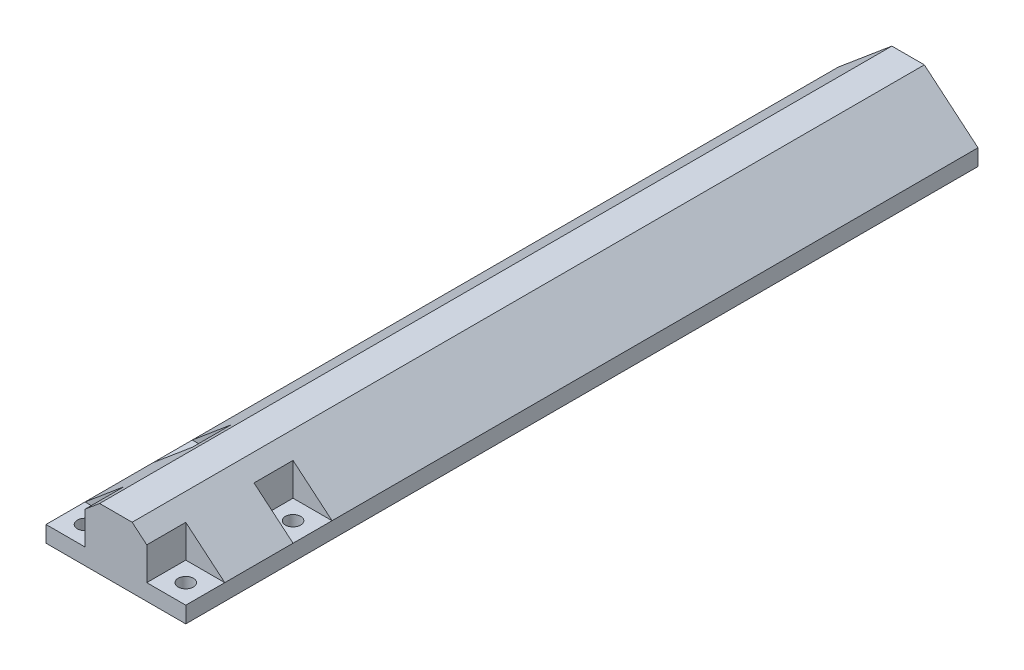
ISO-10303-21;
HEADER;
FILE_DESCRIPTION(('STEP AP214'),'2;1');
FILE_NAME('part.step','',(''),(''),'','','');
FILE_SCHEMA(('AUTOMOTIVE_DESIGN { 1 0 10303 214 1 1 1 1 }'));
ENDSEC;
DATA;
#1=APPLICATION_CONTEXT('core data for automotive mechanical design processes');
#2=APPLICATION_PROTOCOL_DEFINITION('international standard','automotive_design',2000,#1);
#3=PRODUCT_CONTEXT('',#1,'mechanical');
#4=PRODUCT('Part','Part','',(#3));
#5=PRODUCT_RELATED_PRODUCT_CATEGORY('part','',(#4));
#6=PRODUCT_DEFINITION_FORMATION('','',#4);
#7=PRODUCT_DEFINITION_CONTEXT('part definition',#1,'design');
#8=PRODUCT_DEFINITION('design','',#6,#7);
#9=PRODUCT_DEFINITION_SHAPE('','',#8);
#10=(LENGTH_UNIT() NAMED_UNIT(*) SI_UNIT(.MILLI.,.METRE.));
#11=(NAMED_UNIT(*) PLANE_ANGLE_UNIT() SI_UNIT($,.RADIAN.));
#12=(NAMED_UNIT(*) SI_UNIT($,.STERADIAN.) SOLID_ANGLE_UNIT());
#13=UNCERTAINTY_MEASURE_WITH_UNIT(LENGTH_MEASURE(1.E-05),#10,'distance_accuracy_value','');
#14=(GEOMETRIC_REPRESENTATION_CONTEXT(3) GLOBAL_UNCERTAINTY_ASSIGNED_CONTEXT((#13)) GLOBAL_UNIT_ASSIGNED_CONTEXT((#10,
#11,#12)) REPRESENTATION_CONTEXT('',''));
#15=CARTESIAN_POINT('',(0.,0.,0.));
#16=DIRECTION('',(0.,0.,1.));
#17=DIRECTION('',(1.,0.,0.));
#18=AXIS2_PLACEMENT_3D('',#15,#16,#17);
#19=CARTESIAN_POINT('',(-21.5,5.,22.5));
#20=DIRECTION('',(0.,0.,-1.));
#21=DIRECTION('',(-1.,0.,0.));
#22=AXIS2_PLACEMENT_3D('',#19,#20,#21);
#23=PLANE('',#22);
#24=DIRECTION('',(-0.766044443118977,-0.642787609686541,0.));
#25=VECTOR('',#24,1.);
#26=CARTESIAN_POINT('',(-11.3453014726111,13.5208037890486,22.5));
#27=LINE('',#26,#25);
#28=CARTESIAN_POINT('',(-5.00000000000002,18.8451439144252,22.5));
#29=VERTEX_POINT('',#28);
#30=CARTESIAN_POINT('',(-9.5,15.0691955741274,22.5));
#31=VERTEX_POINT('',#30);
#32=EDGE_CURVE('E246',#29,#31,#27,.T.);
#33=ORIENTED_EDGE('',*,*,#32,.T.);
#34=DIRECTION('',(0.,1.,0.));
#35=VECTOR('',#34,1.);
#36=CARTESIAN_POINT('',(-9.5,5.,22.5));
#37=LINE('',#36,#35);
#38=CARTESIAN_POINT('',(-9.5,5.,22.5));
#39=VERTEX_POINT('',#38);
#40=EDGE_CURVE('E214',#39,#31,#37,.T.);
#41=ORIENTED_EDGE('',*,*,#40,.F.);
#42=DIRECTION('',(-1.,0.,0.));
#43=VECTOR('',#42,1.);
#44=CARTESIAN_POINT('',(0.,5.,22.5));
#45=LINE('',#44,#43);
#46=CARTESIAN_POINT('',(-21.5,5.,22.5));
#47=VERTEX_POINT('',#46);
#48=EDGE_CURVE('E206',#39,#47,#45,.T.);
#49=ORIENTED_EDGE('',*,*,#48,.T.);
#50=DIRECTION('',(0.,-1.,0.));
#51=VECTOR('',#50,1.);
#52=CARTESIAN_POINT('',(-21.5,5.,22.5));
#53=LINE('',#52,#51);
#54=CARTESIAN_POINT('',(-21.5,0.,22.5));
#55=VERTEX_POINT('',#54);
#56=EDGE_CURVE('E292',#47,#55,#53,.T.);
#57=ORIENTED_EDGE('',*,*,#56,.T.);
#58=DIRECTION('',(1.,0.,0.));
#59=VECTOR('',#58,1.);
#60=CARTESIAN_POINT('',(-21.5,0.,22.5));
#61=LINE('',#60,#59);
#62=CARTESIAN_POINT('',(21.5,0.,22.5));
#63=VERTEX_POINT('',#62);
#64=EDGE_CURVE('E288',#55,#63,#61,.T.);
#65=ORIENTED_EDGE('',*,*,#64,.T.);
#66=DIRECTION('',(0.,-1.,0.));
#67=VECTOR('',#66,1.);
#68=CARTESIAN_POINT('',(21.5,5.,22.5));
#69=LINE('',#68,#67);
#70=CARTESIAN_POINT('',(21.5,5.,22.5));
#71=VERTEX_POINT('',#70);
#72=EDGE_CURVE('E284',#71,#63,#69,.T.);
#73=ORIENTED_EDGE('',*,*,#72,.F.);
#74=DIRECTION('',(1.,0.,0.));
#75=VECTOR('',#74,1.);
#76=CARTESIAN_POINT('',(0.,5.,22.5));
#77=LINE('',#76,#75);
#78=CARTESIAN_POINT('',(9.5,5.,22.5));
#79=VERTEX_POINT('',#78);
#80=EDGE_CURVE('E220',#79,#71,#77,.T.);
#81=ORIENTED_EDGE('',*,*,#80,.F.);
#82=DIRECTION('',(0.,1.,0.));
#83=VECTOR('',#82,1.);
#84=CARTESIAN_POINT('',(9.5,5.,22.5));
#85=LINE('',#84,#83);
#86=CARTESIAN_POINT('',(9.5,15.0691955741274,22.5));
#87=VERTEX_POINT('',#86);
#88=EDGE_CURVE('E224',#79,#87,#85,.T.);
#89=ORIENTED_EDGE('',*,*,#88,.T.);
#90=DIRECTION('',(-0.766044443118977,0.642787609686541,0.));
#91=VECTOR('',#90,1.);
#92=CARTESIAN_POINT('',(11.3453014726111,13.5208037890486,22.5));
#93=LINE('',#92,#91);
#94=CARTESIAN_POINT('',(4.99999999999999,18.8451439144252,22.5));
#95=VERTEX_POINT('',#94);
#96=EDGE_CURVE('E244',#87,#95,#93,.T.);
#97=ORIENTED_EDGE('',*,*,#96,.T.);
#98=DIRECTION('',(-1.,0.,0.));
#99=VECTOR('',#98,1.);
#100=CARTESIAN_POINT('',(0.,18.8451439144252,22.5));
#101=LINE('',#100,#99);
#102=EDGE_CURVE('E249',#95,#29,#101,.T.);
#103=ORIENTED_EDGE('',*,*,#102,.T.);
#104=EDGE_LOOP('',(#33,#41,#49,#57,#65,#73,#81,#89,#97,#103));
#105=FACE_BOUND('',#104,.T.);
#106=ADVANCED_FACE('F43',(#105),#23,.F.);
#107=CARTESIAN_POINT('',(-11.3453014726111,13.5208037890486,-221.22316262));
#108=DIRECTION('',(0.642787609686541,-0.766044443118977,0.));
#109=DIRECTION('',(0.766044443118977,0.642787609686541,0.));
#110=AXIS2_PLACEMENT_3D('',#107,#108,#109);
#111=PLANE('',#110);
#112=DIRECTION('',(-0.766044443118977,-0.642787609686541,0.));
#113=VECTOR('',#112,1.);
#114=CARTESIAN_POINT('',(-11.3453014726111,13.5208037890486,10.5));
#115=LINE('',#114,#113);
#116=CARTESIAN_POINT('',(-9.5,15.0691955741274,10.5));
#117=VERTEX_POINT('',#116);
#118=CARTESIAN_POINT('',(-21.5,5.,10.5));
#119=VERTEX_POINT('',#118);
#120=EDGE_CURVE('E11',#117,#119,#115,.T.);
#121=ORIENTED_EDGE('',*,*,#120,.F.);
#122=DIRECTION('',(0.,0.,1.));
#123=VECTOR('',#122,1.);
#124=CARTESIAN_POINT('',(-9.5,15.0691955741274,-221.22316262));
#125=LINE('',#124,#123);
#126=EDGE_CURVE('E51',#117,#31,#125,.T.);
#127=ORIENTED_EDGE('',*,*,#126,.T.);
#128=ORIENTED_EDGE('',*,*,#32,.F.);
#129=DIRECTION('',(0.,0.,1.));
#130=VECTOR('',#129,1.);
#131=CARTESIAN_POINT('',(-5.00000000000002,18.8451439144252,-221.22316262));
#132=LINE('',#131,#130);
#133=CARTESIAN_POINT('',(-5.00000000000002,18.8451439144252,-221.22316262));
#134=VERTEX_POINT('',#133);
#135=EDGE_CURVE('E270',#134,#29,#132,.T.);
#136=ORIENTED_EDGE('',*,*,#135,.F.);
#137=DIRECTION('',(0.766044443118977,0.642787609686541,0.));
#138=VECTOR('',#137,1.);
#139=CARTESIAN_POINT('',(-11.3453014726111,13.5208037890486,-221.22316262));
#140=LINE('',#139,#138);
#141=CARTESIAN_POINT('',(-21.5,5.,-221.22316262));
#142=VERTEX_POINT('',#141);
#143=EDGE_CURVE('E252',#142,#134,#140,.T.);
#144=ORIENTED_EDGE('',*,*,#143,.F.);
#145=DIRECTION('',(0.,0.,1.));
#146=VECTOR('',#145,1.);
#147=CARTESIAN_POINT('',(-21.5,5.,22.5));
#148=LINE('',#147,#146);
#149=CARTESIAN_POINT('',(-21.5,5.,-22.5));
#150=VERTEX_POINT('',#149);
#151=EDGE_CURVE('E281',#142,#150,#148,.T.);
#152=ORIENTED_EDGE('',*,*,#151,.T.);
#153=DIRECTION('',(-0.766044443118977,-0.642787609686541,0.));
#154=VECTOR('',#153,1.);
#155=CARTESIAN_POINT('',(-11.3453014726111,13.5208037890486,-22.5));
#156=LINE('',#155,#154);
#157=CARTESIAN_POINT('',(-9.5,15.0691955741274,-22.5));
#158=VERTEX_POINT('',#157);
#159=EDGE_CURVE('E321',#158,#150,#156,.T.);
#160=ORIENTED_EDGE('',*,*,#159,.F.);
#161=DIRECTION('',(0.,0.,1.));
#162=VECTOR('',#161,1.);
#163=CARTESIAN_POINT('',(-9.5,15.0691955741274,-221.22316262));
#164=LINE('',#163,#162);
#165=CARTESIAN_POINT('',(-9.5,15.0691955741274,-10.5));
#166=VERTEX_POINT('',#165);
#167=EDGE_CURVE('E318',#158,#166,#164,.T.);
#168=ORIENTED_EDGE('',*,*,#167,.T.);
#169=DIRECTION('',(-0.766044443118977,-0.642787609686541,0.));
#170=VECTOR('',#169,1.);
#171=CARTESIAN_POINT('',(-11.3453014726111,13.5208037890486,-10.5));
#172=LINE('',#171,#170);
#173=CARTESIAN_POINT('',(-21.5,5.,-10.5));
#174=VERTEX_POINT('',#173);
#175=EDGE_CURVE('E315',#166,#174,#172,.T.);
#176=ORIENTED_EDGE('',*,*,#175,.T.);
#177=EDGE_CURVE('E278',#174,#119,#148,.T.);
#178=ORIENTED_EDGE('',*,*,#177,.T.);
#179=EDGE_LOOP('',(#121,#127,#128,#136,#144,#152,#160,#168,#176,#178));
#180=FACE_BOUND('',#179,.T.);
#181=ADVANCED_FACE('F326',(#180),#111,.F.);
#182=CARTESIAN_POINT('',(11.3453014726111,13.5208037890486,-221.22316262));
#183=DIRECTION('',(-0.642787609686541,-0.766044443118977,0.));
#184=DIRECTION('',(0.766044443118977,-0.642787609686541,0.));
#185=AXIS2_PLACEMENT_3D('',#182,#183,#184);
#186=PLANE('',#185);
#187=DIRECTION('',(-0.766044443118977,0.642787609686541,0.));
#188=VECTOR('',#187,1.);
#189=CARTESIAN_POINT('',(11.3453014726111,13.5208037890486,-22.5));
#190=LINE('',#189,#188);
#191=CARTESIAN_POINT('',(21.5,5.,-22.5));
#192=VERTEX_POINT('',#191);
#193=CARTESIAN_POINT('',(9.5,15.0691955741274,-22.5));
#194=VERTEX_POINT('',#193);
#195=EDGE_CURVE('E179',#192,#194,#190,.T.);
#196=ORIENTED_EDGE('',*,*,#195,.F.);
#197=DIRECTION('',(0.,0.,-1.));
#198=VECTOR('',#197,1.);
#199=CARTESIAN_POINT('',(21.5,5.,22.5));
#200=LINE('',#199,#198);
#201=CARTESIAN_POINT('',(21.5,5.,-221.22316262));
#202=VERTEX_POINT('',#201);
#203=EDGE_CURVE('E280',#192,#202,#200,.T.);
#204=ORIENTED_EDGE('',*,*,#203,.T.);
#205=DIRECTION('',(0.766044443118977,-0.642787609686541,0.));
#206=VECTOR('',#205,1.);
#207=CARTESIAN_POINT('',(11.3453014726111,13.5208037890486,-221.22316262));
#208=LINE('',#207,#206);
#209=CARTESIAN_POINT('',(4.99999999999999,18.8451439144252,-221.22316262));
#210=VERTEX_POINT('',#209);
#211=EDGE_CURVE('E264',#210,#202,#208,.T.);
#212=ORIENTED_EDGE('',*,*,#211,.F.);
#213=DIRECTION('',(0.,0.,1.));
#214=VECTOR('',#213,1.);
#215=CARTESIAN_POINT('',(4.99999999999999,18.8451439144252,-221.22316262));
#216=LINE('',#215,#214);
#217=EDGE_CURVE('E269',#210,#95,#216,.T.);
#218=ORIENTED_EDGE('',*,*,#217,.T.);
#219=ORIENTED_EDGE('',*,*,#96,.F.);
#220=DIRECTION('',(0.,0.,1.));
#221=VECTOR('',#220,1.);
#222=CARTESIAN_POINT('',(9.5,15.0691955741274,-221.22316262));
#223=LINE('',#222,#221);
#224=CARTESIAN_POINT('',(9.5,15.0691955741274,10.5));
#225=VERTEX_POINT('',#224);
#226=EDGE_CURVE('E307',#225,#87,#223,.T.);
#227=ORIENTED_EDGE('',*,*,#226,.F.);
#228=DIRECTION('',(-0.766044443118977,0.642787609686541,0.));
#229=VECTOR('',#228,1.);
#230=CARTESIAN_POINT('',(11.3453014726111,13.5208037890486,10.5));
#231=LINE('',#230,#229);
#232=CARTESIAN_POINT('',(21.5,5.,10.5));
#233=VERTEX_POINT('',#232);
#234=EDGE_CURVE('E295',#233,#225,#231,.T.);
#235=ORIENTED_EDGE('',*,*,#234,.F.);
#236=CARTESIAN_POINT('',(21.5,5.,-10.5));
#237=VERTEX_POINT('',#236);
#238=EDGE_CURVE('E279',#233,#237,#200,.T.);
#239=ORIENTED_EDGE('',*,*,#238,.T.);
#240=DIRECTION('',(-0.766044443118977,0.642787609686541,0.));
#241=VECTOR('',#240,1.);
#242=CARTESIAN_POINT('',(11.3453014726111,13.5208037890486,-10.5));
#243=LINE('',#242,#241);
#244=CARTESIAN_POINT('',(9.5,15.0691955741274,-10.5));
#245=VERTEX_POINT('',#244);
#246=EDGE_CURVE('E311',#237,#245,#243,.T.);
#247=ORIENTED_EDGE('',*,*,#246,.T.);
#248=DIRECTION('',(0.,0.,1.));
#249=VECTOR('',#248,1.);
#250=CARTESIAN_POINT('',(9.5,15.0691955741274,-221.22316262));
#251=LINE('',#250,#249);
#252=EDGE_CURVE('E309',#194,#245,#251,.T.);
#253=ORIENTED_EDGE('',*,*,#252,.F.);
#254=EDGE_LOOP('',(#196,#204,#212,#218,#219,#227,#235,#239,#247,#253));
#255=FACE_BOUND('',#254,.T.);
#256=ADVANCED_FACE('F379',(#255),#186,.F.);
#257=CARTESIAN_POINT('',(15.5,18.8451439144252,-16.5));
#258=DIRECTION('',(0.,-1.,0.));
#259=DIRECTION('',(0.,0.,-1.));
#260=AXIS2_PLACEMENT_3D('',#257,#258,#259);
#261=CYLINDRICAL_SURFACE('',#260,2.35);
#262=CARTESIAN_POINT('',(15.5,0.,-16.5));
#263=DIRECTION('',(0.,-1.,0.));
#264=DIRECTION('',(0.,0.,-1.));
#265=AXIS2_PLACEMENT_3D('',#262,#263,#264);
#266=CIRCLE('',#265,2.35);
#267=CARTESIAN_POINT('',(15.5,0.,-18.85));
#268=VERTEX_POINT('',#267);
#269=EDGE_CURVE('E234',#268,#268,#266,.T.);
#270=ORIENTED_EDGE('',*,*,#269,.T.);
#271=EDGE_LOOP('',(#270));
#272=FACE_BOUND('',#271,.T.);
#273=CARTESIAN_POINT('',(15.5,5.,-16.5));
#274=DIRECTION('',(0.,1.,0.));
#275=DIRECTION('',(0.,0.,1.));
#276=AXIS2_PLACEMENT_3D('',#273,#274,#275);
#277=CIRCLE('',#276,2.35);
#278=CARTESIAN_POINT('',(15.5,5.,-14.15));
#279=VERTEX_POINT('',#278);
#280=EDGE_CURVE('E241',#279,#279,#277,.F.);
#281=ORIENTED_EDGE('',*,*,#280,.F.);
#282=EDGE_LOOP('',(#281));
#283=FACE_BOUND('',#282,.T.);
#284=ADVANCED_FACE('F434',(#272,#283),#261,.F.);
#285=CARTESIAN_POINT('',(15.5,18.8451439144252,16.5));
#286=DIRECTION('',(0.,-1.,0.));
#287=DIRECTION('',(0.,0.,-1.));
#288=AXIS2_PLACEMENT_3D('',#285,#286,#287);
#289=CYLINDRICAL_SURFACE('',#288,2.35);
#290=CARTESIAN_POINT('',(15.5,0.,16.5));
#291=DIRECTION('',(0.,-1.,0.));
#292=DIRECTION('',(0.,0.,-1.));
#293=AXIS2_PLACEMENT_3D('',#290,#291,#292);
#294=CIRCLE('',#293,2.35);
#295=CARTESIAN_POINT('',(15.5,0.,14.15));
#296=VERTEX_POINT('',#295);
#297=EDGE_CURVE('E238',#296,#296,#294,.T.);
#298=ORIENTED_EDGE('',*,*,#297,.T.);
#299=EDGE_LOOP('',(#298));
#300=FACE_BOUND('',#299,.T.);
#301=CARTESIAN_POINT('',(15.5,5.,16.5));
#302=DIRECTION('',(0.,1.,0.));
#303=DIRECTION('',(0.,0.,1.));
#304=AXIS2_PLACEMENT_3D('',#301,#302,#303);
#305=CIRCLE('',#304,2.35);
#306=CARTESIAN_POINT('',(15.5,5.,18.85));
#307=VERTEX_POINT('',#306);
#308=EDGE_CURVE('E301',#307,#307,#305,.F.);
#309=ORIENTED_EDGE('',*,*,#308,.F.);
#310=EDGE_LOOP('',(#309));
#311=FACE_BOUND('',#310,.T.);
#312=ADVANCED_FACE('F429',(#300,#311),#289,.F.);
#313=CARTESIAN_POINT('',(-15.5,18.8451439144252,-16.5));
#314=DIRECTION('',(0.,-1.,0.));
#315=DIRECTION('',(0.,0.,-1.));
#316=AXIS2_PLACEMENT_3D('',#313,#314,#315);
#317=CYLINDRICAL_SURFACE('',#316,2.35);
#318=CARTESIAN_POINT('',(-15.5,0.,-16.5));
#319=DIRECTION('',(0.,-1.,0.));
#320=DIRECTION('',(0.,0.,-1.));
#321=AXIS2_PLACEMENT_3D('',#318,#319,#320);
#322=CIRCLE('',#321,2.35);
#323=CARTESIAN_POINT('',(-15.5,0.,-18.85));
#324=VERTEX_POINT('',#323);
#325=EDGE_CURVE('E231',#324,#324,#322,.T.);
#326=ORIENTED_EDGE('',*,*,#325,.T.);
#327=EDGE_LOOP('',(#326));
#328=FACE_BOUND('',#327,.T.);
#329=CARTESIAN_POINT('',(-15.5,5.,-16.5));
#330=DIRECTION('',(0.,1.,0.));
#331=DIRECTION('',(0.,0.,1.));
#332=AXIS2_PLACEMENT_3D('',#329,#330,#331);
#333=CIRCLE('',#332,2.35);
#334=CARTESIAN_POINT('',(-15.5,5.,-14.15));
#335=VERTEX_POINT('',#334);
#336=EDGE_CURVE('E298',#335,#335,#333,.F.);
#337=ORIENTED_EDGE('',*,*,#336,.F.);
#338=EDGE_LOOP('',(#337));
#339=FACE_BOUND('',#338,.T.);
#340=ADVANCED_FACE('F394',(#328,#339),#317,.F.);
#341=CARTESIAN_POINT('',(-15.5,18.8451439144252,16.5));
#342=DIRECTION('',(0.,-1.,0.));
#343=DIRECTION('',(0.,0.,-1.));
#344=AXIS2_PLACEMENT_3D('',#341,#342,#343);
#345=CYLINDRICAL_SURFACE('',#344,2.35);
#346=CARTESIAN_POINT('',(-15.5,0.,16.5));
#347=DIRECTION('',(0.,-1.,0.));
#348=DIRECTION('',(0.,0.,-1.));
#349=AXIS2_PLACEMENT_3D('',#346,#347,#348);
#350=CIRCLE('',#349,2.35);
#351=CARTESIAN_POINT('',(-15.5,0.,14.15));
#352=VERTEX_POINT('',#351);
#353=EDGE_CURVE('E235',#352,#352,#350,.T.);
#354=ORIENTED_EDGE('',*,*,#353,.T.);
#355=EDGE_LOOP('',(#354));
#356=FACE_BOUND('',#355,.T.);
#357=CARTESIAN_POINT('',(-15.5,5.,16.5));
#358=DIRECTION('',(0.,1.,0.));
#359=DIRECTION('',(0.,0.,1.));
#360=AXIS2_PLACEMENT_3D('',#357,#358,#359);
#361=CIRCLE('',#360,2.35);
#362=CARTESIAN_POINT('',(-15.5,5.,18.85));
#363=VERTEX_POINT('',#362);
#364=EDGE_CURVE('E228',#363,#363,#361,.F.);
#365=ORIENTED_EDGE('',*,*,#364,.F.);
#366=EDGE_LOOP('',(#365));
#367=FACE_BOUND('',#366,.T.);
#368=ADVANCED_FACE('F389',(#356,#367),#345,.F.);
#369=CARTESIAN_POINT('',(21.5,5.,22.5));
#370=DIRECTION('',(-1.,0.,0.));
#371=DIRECTION('',(0.,0.,1.));
#372=AXIS2_PLACEMENT_3D('',#369,#370,#371);
#373=PLANE('',#372);
#374=DIRECTION('',(0.,0.,-1.));
#375=VECTOR('',#374,1.);
#376=CARTESIAN_POINT('',(21.5,0.,22.5));
#377=LINE('',#376,#375);
#378=CARTESIAN_POINT('',(21.5,0.,-221.22316262));
#379=VERTEX_POINT('',#378);
#380=EDGE_CURVE('E272',#63,#379,#377,.T.);
#381=ORIENTED_EDGE('',*,*,#380,.T.);
#382=DIRECTION('',(0.,1.,0.));
#383=VECTOR('',#382,1.);
#384=CARTESIAN_POINT('',(21.5,0.,-221.22316262));
#385=LINE('',#384,#383);
#386=EDGE_CURVE('E261',#379,#202,#385,.T.);
#387=ORIENTED_EDGE('',*,*,#386,.T.);
#388=ORIENTED_EDGE('',*,*,#203,.F.);
#389=DIRECTION('',(0.,0.,1.));
#390=VECTOR('',#389,1.);
#391=CARTESIAN_POINT('',(21.5,5.,0.));
#392=LINE('',#391,#390);
#393=EDGE_CURVE('E180',#192,#237,#392,.T.);
#394=ORIENTED_EDGE('',*,*,#393,.T.);
#395=ORIENTED_EDGE('',*,*,#238,.F.);
#396=EDGE_CURVE('E275',#71,#233,#200,.T.);
#397=ORIENTED_EDGE('',*,*,#396,.F.);
#398=ORIENTED_EDGE('',*,*,#72,.T.);
#399=EDGE_LOOP('',(#381,#387,#388,#394,#395,#397,#398));
#400=FACE_BOUND('',#399,.T.);
#401=ADVANCED_FACE('F45',(#400),#373,.F.);
#402=CARTESIAN_POINT('',(-21.5,5.,22.5));
#403=DIRECTION('',(1.,0.,0.));
#404=DIRECTION('',(0.,0.,-1.));
#405=AXIS2_PLACEMENT_3D('',#402,#403,#404);
#406=PLANE('',#405);
#407=DIRECTION('',(0.,0.,1.));
#408=VECTOR('',#407,1.);
#409=CARTESIAN_POINT('',(-21.5,0.,22.5));
#410=LINE('',#409,#408);
#411=CARTESIAN_POINT('',(-21.5,0.,-221.22316262));
#412=VERTEX_POINT('',#411);
#413=EDGE_CURVE('E286',#412,#55,#410,.T.);
#414=ORIENTED_EDGE('',*,*,#413,.T.);
#415=ORIENTED_EDGE('',*,*,#56,.F.);
#416=DIRECTION('',(0.,0.,1.));
#417=VECTOR('',#416,1.);
#418=CARTESIAN_POINT('',(-21.5,5.,0.));
#419=LINE('',#418,#417);
#420=EDGE_CURVE('E212',#119,#47,#419,.T.);
#421=ORIENTED_EDGE('',*,*,#420,.F.);
#422=ORIENTED_EDGE('',*,*,#177,.F.);
#423=DIRECTION('',(0.,0.,1.));
#424=VECTOR('',#423,1.);
#425=CARTESIAN_POINT('',(-21.5,5.,0.));
#426=LINE('',#425,#424);
#427=EDGE_CURVE('E196',#150,#174,#426,.T.);
#428=ORIENTED_EDGE('',*,*,#427,.F.);
#429=ORIENTED_EDGE('',*,*,#151,.F.);
#430=DIRECTION('',(0.,-1.,0.));
#431=VECTOR('',#430,1.);
#432=CARTESIAN_POINT('',(-21.5,0.,-221.22316262));
#433=LINE('',#432,#431);
#434=EDGE_CURVE('E255',#142,#412,#433,.T.);
#435=ORIENTED_EDGE('',*,*,#434,.T.);
#436=EDGE_LOOP('',(#414,#415,#421,#422,#428,#429,#435));
#437=FACE_BOUND('',#436,.T.);
#438=ADVANCED_FACE('F347',(#437),#406,.F.);
#439=CARTESIAN_POINT('',(0.,0.,0.));
#440=DIRECTION('',(0.,-1.,0.));
#441=DIRECTION('',(0.,0.,-1.));
#442=AXIS2_PLACEMENT_3D('',#439,#440,#441);
#443=PLANE('',#442);
#444=ORIENTED_EDGE('',*,*,#297,.F.);
#445=EDGE_LOOP('',(#444));
#446=FACE_BOUND('',#445,.T.);
#447=ORIENTED_EDGE('',*,*,#353,.F.);
#448=EDGE_LOOP('',(#447));
#449=FACE_BOUND('',#448,.T.);
#450=ORIENTED_EDGE('',*,*,#325,.F.);
#451=EDGE_LOOP('',(#450));
#452=FACE_BOUND('',#451,.T.);
#453=ORIENTED_EDGE('',*,*,#269,.F.);
#454=EDGE_LOOP('',(#453));
#455=FACE_BOUND('',#454,.T.);
#456=ORIENTED_EDGE('',*,*,#380,.F.);
#457=ORIENTED_EDGE('',*,*,#64,.F.);
#458=ORIENTED_EDGE('',*,*,#413,.F.);
#459=DIRECTION('',(1.,0.,0.));
#460=VECTOR('',#459,1.);
#461=CARTESIAN_POINT('',(0.,0.,-221.22316262));
#462=LINE('',#461,#460);
#463=EDGE_CURVE('E258',#412,#379,#462,.T.);
#464=ORIENTED_EDGE('',*,*,#463,.T.);
#465=EDGE_LOOP('',(#456,#457,#458,#464));
#466=FACE_BOUND('',#465,.T.);
#467=ADVANCED_FACE('F382',(#446,#449,#452,#455,#466),#443,.T.);
#468=CARTESIAN_POINT('',(0.,18.8451439144252,-221.22316262));
#469=DIRECTION('',(0.,-1.,0.));
#470=DIRECTION('',(0.,0.,-1.));
#471=AXIS2_PLACEMENT_3D('',#468,#469,#470);
#472=PLANE('',#471);
#473=ORIENTED_EDGE('',*,*,#135,.T.);
#474=ORIENTED_EDGE('',*,*,#102,.F.);
#475=ORIENTED_EDGE('',*,*,#217,.F.);
#476=DIRECTION('',(1.,0.,0.));
#477=VECTOR('',#476,1.);
#478=CARTESIAN_POINT('',(0.,18.8451439144252,-221.22316262));
#479=LINE('',#478,#477);
#480=EDGE_CURVE('E267',#134,#210,#479,.T.);
#481=ORIENTED_EDGE('',*,*,#480,.F.);
#482=EDGE_LOOP('',(#473,#474,#475,#481));
#483=FACE_BOUND('',#482,.T.);
#484=ADVANCED_FACE('F337',(#483),#472,.F.);
#485=CARTESIAN_POINT('',(0.,0.,-221.22316262));
#486=DIRECTION('',(0.,0.,1.));
#487=DIRECTION('',(1.,0.,0.));
#488=AXIS2_PLACEMENT_3D('',#485,#486,#487);
#489=PLANE('',#488);
#490=ORIENTED_EDGE('',*,*,#143,.T.);
#491=ORIENTED_EDGE('',*,*,#480,.T.);
#492=ORIENTED_EDGE('',*,*,#211,.T.);
#493=ORIENTED_EDGE('',*,*,#386,.F.);
#494=ORIENTED_EDGE('',*,*,#463,.F.);
#495=ORIENTED_EDGE('',*,*,#434,.F.);
#496=EDGE_LOOP('',(#490,#491,#492,#493,#494,#495));
#497=FACE_BOUND('',#496,.T.);
#498=ADVANCED_FACE('F344',(#497),#489,.F.);
#499=CARTESIAN_POINT('',(0.,5.,10.5));
#500=DIRECTION('',(0.,0.,1.));
#501=DIRECTION('',(1.,0.,0.));
#502=AXIS2_PLACEMENT_3D('',#499,#500,#501);
#503=PLANE('',#502);
#504=ORIENTED_EDGE('',*,*,#120,.T.);
#505=DIRECTION('',(1.,0.,0.));
#506=VECTOR('',#505,1.);
#507=CARTESIAN_POINT('',(0.,5.,10.5));
#508=LINE('',#507,#506);
#509=CARTESIAN_POINT('',(-9.5,5.,10.5));
#510=VERTEX_POINT('',#509);
#511=EDGE_CURVE('E58',#119,#510,#508,.T.);
#512=ORIENTED_EDGE('',*,*,#511,.T.);
#513=DIRECTION('',(0.,1.,0.));
#514=VECTOR('',#513,1.);
#515=CARTESIAN_POINT('',(-9.5,5.,10.5));
#516=LINE('',#515,#514);
#517=EDGE_CURVE('E197',#510,#117,#516,.T.);
#518=ORIENTED_EDGE('',*,*,#517,.T.);
#519=EDGE_LOOP('',(#504,#512,#518));
#520=FACE_BOUND('',#519,.T.);
#521=ADVANCED_FACE('F407',(#520),#503,.T.);
#522=CARTESIAN_POINT('',(-9.5,5.,0.));
#523=DIRECTION('',(1.,0.,0.));
#524=DIRECTION('',(0.,0.,-1.));
#525=AXIS2_PLACEMENT_3D('',#522,#523,#524);
#526=PLANE('',#525);
#527=ORIENTED_EDGE('',*,*,#517,.F.);
#528=DIRECTION('',(0.,0.,-1.));
#529=VECTOR('',#528,1.);
#530=CARTESIAN_POINT('',(-9.5,5.,0.));
#531=LINE('',#530,#529);
#532=EDGE_CURVE('E209',#39,#510,#531,.T.);
#533=ORIENTED_EDGE('',*,*,#532,.F.);
#534=ORIENTED_EDGE('',*,*,#40,.T.);
#535=ORIENTED_EDGE('',*,*,#126,.F.);
#536=EDGE_LOOP('',(#527,#533,#534,#535));
#537=FACE_BOUND('',#536,.T.);
#538=ADVANCED_FACE('F370',(#537),#526,.F.);
#539=CARTESIAN_POINT('',(0.,5.,0.));
#540=DIRECTION('',(0.,1.,0.));
#541=DIRECTION('',(0.,0.,1.));
#542=AXIS2_PLACEMENT_3D('',#539,#540,#541);
#543=PLANE('',#542);
#544=ORIENTED_EDGE('',*,*,#48,.F.);
#545=ORIENTED_EDGE('',*,*,#532,.T.);
#546=ORIENTED_EDGE('',*,*,#511,.F.);
#547=ORIENTED_EDGE('',*,*,#420,.T.);
#548=EDGE_LOOP('',(#544,#545,#546,#547));
#549=FACE_BOUND('',#548,.T.);
#550=ORIENTED_EDGE('',*,*,#364,.T.);
#551=EDGE_LOOP('',(#550));
#552=FACE_BOUND('',#551,.T.);
#553=ADVANCED_FACE('F363',(#549,#552),#543,.T.);
#554=CARTESIAN_POINT('',(0.,5.,-22.5));
#555=DIRECTION('',(0.,0.,1.));
#556=DIRECTION('',(1.,0.,0.));
#557=AXIS2_PLACEMENT_3D('',#554,#555,#556);
#558=PLANE('',#557);
#559=ORIENTED_EDGE('',*,*,#159,.T.);
#560=DIRECTION('',(1.,0.,0.));
#561=VECTOR('',#560,1.);
#562=CARTESIAN_POINT('',(0.,5.,-22.5));
#563=LINE('',#562,#561);
#564=CARTESIAN_POINT('',(-9.5,5.,-22.5));
#565=VERTEX_POINT('',#564);
#566=EDGE_CURVE('E65',#150,#565,#563,.T.);
#567=ORIENTED_EDGE('',*,*,#566,.T.);
#568=DIRECTION('',(0.,1.,0.));
#569=VECTOR('',#568,1.);
#570=CARTESIAN_POINT('',(-9.5,5.,-22.5));
#571=LINE('',#570,#569);
#572=EDGE_CURVE('E185',#565,#158,#571,.T.);
#573=ORIENTED_EDGE('',*,*,#572,.T.);
#574=EDGE_LOOP('',(#559,#567,#573));
#575=FACE_BOUND('',#574,.T.);
#576=ADVANCED_FACE('F361',(#575),#558,.T.);
#577=CARTESIAN_POINT('',(-9.5,5.,0.));
#578=DIRECTION('',(1.,0.,0.));
#579=DIRECTION('',(0.,0.,-1.));
#580=AXIS2_PLACEMENT_3D('',#577,#578,#579);
#581=PLANE('',#580);
#582=ORIENTED_EDGE('',*,*,#572,.F.);
#583=DIRECTION('',(0.,0.,-1.));
#584=VECTOR('',#583,1.);
#585=CARTESIAN_POINT('',(-9.5,5.,0.));
#586=LINE('',#585,#584);
#587=CARTESIAN_POINT('',(-9.5,5.,-10.5));
#588=VERTEX_POINT('',#587);
#589=EDGE_CURVE('E202',#588,#565,#586,.T.);
#590=ORIENTED_EDGE('',*,*,#589,.F.);
#591=DIRECTION('',(0.,1.,0.));
#592=VECTOR('',#591,1.);
#593=CARTESIAN_POINT('',(-9.5,5.,-10.5));
#594=LINE('',#593,#592);
#595=EDGE_CURVE('E188',#588,#166,#594,.T.);
#596=ORIENTED_EDGE('',*,*,#595,.T.);
#597=ORIENTED_EDGE('',*,*,#167,.F.);
#598=EDGE_LOOP('',(#582,#590,#596,#597));
#599=FACE_BOUND('',#598,.T.);
#600=ADVANCED_FACE('F359',(#599),#581,.F.);
#601=CARTESIAN_POINT('',(0.,5.,-10.5));
#602=DIRECTION('',(0.,0.,1.));
#603=DIRECTION('',(1.,0.,0.));
#604=AXIS2_PLACEMENT_3D('',#601,#602,#603);
#605=PLANE('',#604);
#606=ORIENTED_EDGE('',*,*,#595,.F.);
#607=DIRECTION('',(1.,0.,0.));
#608=VECTOR('',#607,1.);
#609=CARTESIAN_POINT('',(0.,5.,-10.5));
#610=LINE('',#609,#608);
#611=EDGE_CURVE('E199',#174,#588,#610,.T.);
#612=ORIENTED_EDGE('',*,*,#611,.F.);
#613=ORIENTED_EDGE('',*,*,#175,.F.);
#614=EDGE_LOOP('',(#606,#612,#613));
#615=FACE_BOUND('',#614,.T.);
#616=ADVANCED_FACE('F356',(#615),#605,.F.);
#617=CARTESIAN_POINT('',(0.,5.,0.));
#618=DIRECTION('',(0.,1.,0.));
#619=DIRECTION('',(0.,0.,1.));
#620=AXIS2_PLACEMENT_3D('',#617,#618,#619);
#621=PLANE('',#620);
#622=ORIENTED_EDGE('',*,*,#566,.F.);
#623=ORIENTED_EDGE('',*,*,#427,.T.);
#624=ORIENTED_EDGE('',*,*,#611,.T.);
#625=ORIENTED_EDGE('',*,*,#589,.T.);
#626=EDGE_LOOP('',(#622,#623,#624,#625));
#627=FACE_BOUND('',#626,.T.);
#628=ORIENTED_EDGE('',*,*,#336,.T.);
#629=EDGE_LOOP('',(#628));
#630=FACE_BOUND('',#629,.T.);
#631=ADVANCED_FACE('F352',(#627,#630),#621,.T.);
#632=CARTESIAN_POINT('',(9.5,5.,0.));
#633=DIRECTION('',(1.,0.,0.));
#634=DIRECTION('',(0.,0.,-1.));
#635=AXIS2_PLACEMENT_3D('',#632,#633,#634);
#636=PLANE('',#635);
#637=ORIENTED_EDGE('',*,*,#226,.T.);
#638=ORIENTED_EDGE('',*,*,#88,.F.);
#639=DIRECTION('',(0.,0.,-1.));
#640=VECTOR('',#639,1.);
#641=CARTESIAN_POINT('',(9.5,5.,0.));
#642=LINE('',#641,#640);
#643=CARTESIAN_POINT('',(9.5,5.,10.5));
#644=VERTEX_POINT('',#643);
#645=EDGE_CURVE('E193',#79,#644,#642,.T.);
#646=ORIENTED_EDGE('',*,*,#645,.T.);
#647=DIRECTION('',(0.,1.,0.));
#648=VECTOR('',#647,1.);
#649=CARTESIAN_POINT('',(9.5,5.,10.5));
#650=LINE('',#649,#648);
#651=EDGE_CURVE('E225',#644,#225,#650,.T.);
#652=ORIENTED_EDGE('',*,*,#651,.T.);
#653=EDGE_LOOP('',(#637,#638,#646,#652));
#654=FACE_BOUND('',#653,.T.);
#655=ADVANCED_FACE('F423',(#654),#636,.T.);
#656=CARTESIAN_POINT('',(0.,5.,10.5));
#657=DIRECTION('',(0.,0.,1.));
#658=DIRECTION('',(1.,0.,0.));
#659=AXIS2_PLACEMENT_3D('',#656,#657,#658);
#660=PLANE('',#659);
#661=ORIENTED_EDGE('',*,*,#234,.T.);
#662=ORIENTED_EDGE('',*,*,#651,.F.);
#663=DIRECTION('',(1.,0.,0.));
#664=VECTOR('',#663,1.);
#665=CARTESIAN_POINT('',(0.,5.,10.5));
#666=LINE('',#665,#664);
#667=EDGE_CURVE('E222',#644,#233,#666,.T.);
#668=ORIENTED_EDGE('',*,*,#667,.T.);
#669=EDGE_LOOP('',(#661,#662,#668));
#670=FACE_BOUND('',#669,.T.);
#671=ADVANCED_FACE('F419',(#670),#660,.T.);
#672=CARTESIAN_POINT('',(0.,5.,0.));
#673=DIRECTION('',(0.,1.,0.));
#674=DIRECTION('',(0.,0.,1.));
#675=AXIS2_PLACEMENT_3D('',#672,#673,#674);
#676=PLANE('',#675);
#677=ORIENTED_EDGE('',*,*,#645,.F.);
#678=ORIENTED_EDGE('',*,*,#80,.T.);
#679=ORIENTED_EDGE('',*,*,#396,.T.);
#680=ORIENTED_EDGE('',*,*,#667,.F.);
#681=EDGE_LOOP('',(#677,#678,#679,#680));
#682=FACE_BOUND('',#681,.T.);
#683=ORIENTED_EDGE('',*,*,#308,.T.);
#684=EDGE_LOOP('',(#683));
#685=FACE_BOUND('',#684,.T.);
#686=ADVANCED_FACE('F416',(#682,#685),#676,.T.);
#687=CARTESIAN_POINT('',(0.,5.,-22.5));
#688=DIRECTION('',(0.,0.,1.));
#689=DIRECTION('',(1.,0.,0.));
#690=AXIS2_PLACEMENT_3D('',#687,#688,#689);
#691=PLANE('',#690);
#692=ORIENTED_EDGE('',*,*,#195,.T.);
#693=DIRECTION('',(0.,1.,0.));
#694=VECTOR('',#693,1.);
#695=CARTESIAN_POINT('',(9.5,5.,-22.5));
#696=LINE('',#695,#694);
#697=CARTESIAN_POINT('',(9.5,5.,-22.5));
#698=VERTEX_POINT('',#697);
#699=EDGE_CURVE('E165',#698,#194,#696,.T.);
#700=ORIENTED_EDGE('',*,*,#699,.F.);
#701=DIRECTION('',(1.,0.,0.));
#702=VECTOR('',#701,1.);
#703=CARTESIAN_POINT('',(0.,5.,-22.5));
#704=LINE('',#703,#702);
#705=EDGE_CURVE('E173',#698,#192,#704,.T.);
#706=ORIENTED_EDGE('',*,*,#705,.T.);
#707=EDGE_LOOP('',(#692,#700,#706));
#708=FACE_BOUND('',#707,.T.);
#709=ADVANCED_FACE('F177',(#708),#691,.T.);
#710=CARTESIAN_POINT('',(0.,5.,-10.5));
#711=DIRECTION('',(0.,0.,1.));
#712=DIRECTION('',(1.,0.,0.));
#713=AXIS2_PLACEMENT_3D('',#710,#711,#712);
#714=PLANE('',#713);
#715=DIRECTION('',(1.,0.,0.));
#716=VECTOR('',#715,1.);
#717=CARTESIAN_POINT('',(0.,5.,-10.5));
#718=LINE('',#717,#716);
#719=CARTESIAN_POINT('',(9.5,5.,-10.5));
#720=VERTEX_POINT('',#719);
#721=EDGE_CURVE('E172',#720,#237,#718,.T.);
#722=ORIENTED_EDGE('',*,*,#721,.F.);
#723=DIRECTION('',(0.,1.,0.));
#724=VECTOR('',#723,1.);
#725=CARTESIAN_POINT('',(9.5,5.,-10.5));
#726=LINE('',#725,#724);
#727=EDGE_CURVE('E168',#720,#245,#726,.T.);
#728=ORIENTED_EDGE('',*,*,#727,.T.);
#729=ORIENTED_EDGE('',*,*,#246,.F.);
#730=EDGE_LOOP('',(#722,#728,#729));
#731=FACE_BOUND('',#730,.T.);
#732=ADVANCED_FACE('F456',(#731),#714,.F.);
#733=CARTESIAN_POINT('',(9.5,5.,0.));
#734=DIRECTION('',(1.,0.,0.));
#735=DIRECTION('',(0.,0.,-1.));
#736=AXIS2_PLACEMENT_3D('',#733,#734,#735);
#737=PLANE('',#736);
#738=ORIENTED_EDGE('',*,*,#252,.T.);
#739=ORIENTED_EDGE('',*,*,#727,.F.);
#740=DIRECTION('',(0.,0.,-1.));
#741=VECTOR('',#740,1.);
#742=CARTESIAN_POINT('',(9.5,5.,0.));
#743=LINE('',#742,#741);
#744=EDGE_CURVE('E162',#720,#698,#743,.T.);
#745=ORIENTED_EDGE('',*,*,#744,.T.);
#746=ORIENTED_EDGE('',*,*,#699,.T.);
#747=EDGE_LOOP('',(#738,#739,#745,#746));
#748=FACE_BOUND('',#747,.T.);
#749=ADVANCED_FACE('F164',(#748),#737,.T.);
#750=CARTESIAN_POINT('',(0.,5.,0.));
#751=DIRECTION('',(0.,1.,0.));
#752=DIRECTION('',(0.,0.,1.));
#753=AXIS2_PLACEMENT_3D('',#750,#751,#752);
#754=PLANE('',#753);
#755=ORIENTED_EDGE('',*,*,#705,.F.);
#756=ORIENTED_EDGE('',*,*,#744,.F.);
#757=ORIENTED_EDGE('',*,*,#721,.T.);
#758=ORIENTED_EDGE('',*,*,#393,.F.);
#759=EDGE_LOOP('',(#755,#756,#757,#758));
#760=FACE_BOUND('',#759,.T.);
#761=ORIENTED_EDGE('',*,*,#280,.T.);
#762=EDGE_LOOP('',(#761));
#763=FACE_BOUND('',#762,.T.);
#764=ADVANCED_FACE('F182',(#760,#763),#754,.T.);
#765=CLOSED_SHELL('',(#106,#181,#256,#284,#312,#340,#368,#401,#438,#467,#484,#498,#521,#538,
#553,#576,#600,#616,#631,#655,#671,#686,#709,#732,#749,#764));
#766=MANIFOLD_SOLID_BREP('B2',#765);
#767=ADVANCED_BREP_SHAPE_REPRESENTATION('',(#18,#766),#14);
#768=SHAPE_DEFINITION_REPRESENTATION(#9,#767);
ENDSEC;
END-ISO-10303-21;
